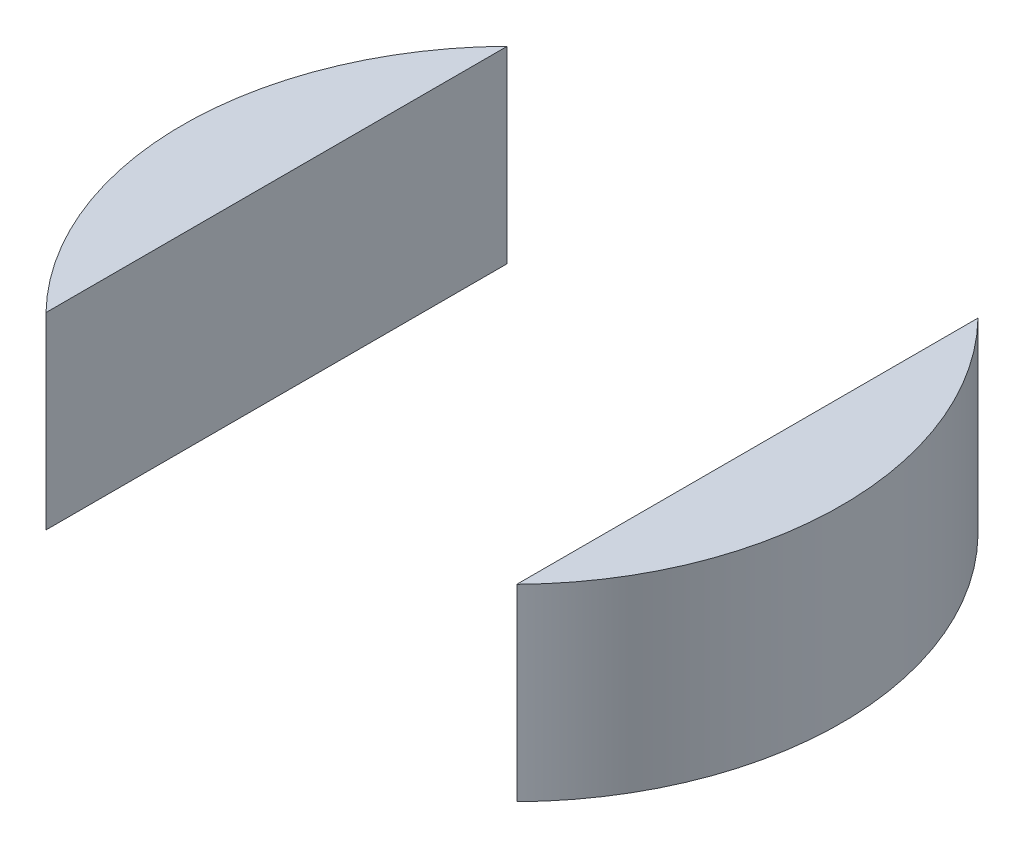
ISO-10303-21;
HEADER;
FILE_DESCRIPTION(('STEP AP214'),'2;1');
FILE_NAME('part.step','',(''),(''),'','','');
FILE_SCHEMA(('AUTOMOTIVE_DESIGN { 1 0 10303 214 1 1 1 1 }'));
ENDSEC;
DATA;
#1=APPLICATION_CONTEXT('core data for automotive mechanical design processes');
#2=APPLICATION_PROTOCOL_DEFINITION('international standard','automotive_design',2000,#1);
#3=PRODUCT_CONTEXT('',#1,'mechanical');
#4=PRODUCT('Part','Part','',(#3));
#5=PRODUCT_RELATED_PRODUCT_CATEGORY('part','',(#4));
#6=PRODUCT_DEFINITION_FORMATION('','',#4);
#7=PRODUCT_DEFINITION_CONTEXT('part definition',#1,'design');
#8=PRODUCT_DEFINITION('design','',#6,#7);
#9=PRODUCT_DEFINITION_SHAPE('','',#8);
#10=(LENGTH_UNIT() NAMED_UNIT(*) SI_UNIT(.MILLI.,.METRE.));
#11=(NAMED_UNIT(*) PLANE_ANGLE_UNIT() SI_UNIT($,.RADIAN.));
#12=(NAMED_UNIT(*) SI_UNIT($,.STERADIAN.) SOLID_ANGLE_UNIT());
#13=UNCERTAINTY_MEASURE_WITH_UNIT(LENGTH_MEASURE(1.E-05),#10,'distance_accuracy_value','');
#14=(GEOMETRIC_REPRESENTATION_CONTEXT(3) GLOBAL_UNCERTAINTY_ASSIGNED_CONTEXT((#13)) GLOBAL_UNIT_ASSIGNED_CONTEXT((#10,
#11,#12)) REPRESENTATION_CONTEXT('',''));
#15=CARTESIAN_POINT('',(0.,0.,0.));
#16=DIRECTION('',(0.,0.,1.));
#17=DIRECTION('',(1.,0.,0.));
#18=AXIS2_PLACEMENT_3D('',#15,#16,#17);
#19=CARTESIAN_POINT('',(0.,10.,0.));
#20=DIRECTION('',(0.,-1.,0.));
#21=DIRECTION('',(0.,0.,-1.));
#22=AXIS2_PLACEMENT_3D('',#19,#20,#21);
#23=CYLINDRICAL_SURFACE('',#22,17.5);
#24=CARTESIAN_POINT('',(0.,0.,0.));
#25=DIRECTION('',(0.,1.,0.));
#26=DIRECTION('',(0.,0.,1.));
#27=AXIS2_PLACEMENT_3D('',#24,#25,#26);
#28=CIRCLE('',#27,17.5);
#29=CARTESIAN_POINT('',(12.5,0.,12.2474487139159));
#30=VERTEX_POINT('',#29);
#31=CARTESIAN_POINT('',(12.5,0.,-12.2474487139159));
#32=VERTEX_POINT('',#31);
#33=EDGE_CURVE('E90',#30,#32,#28,.T.);
#34=ORIENTED_EDGE('',*,*,#33,.T.);
#35=DIRECTION('',(0.,-1.,0.));
#36=VECTOR('',#35,1.);
#37=CARTESIAN_POINT('',(12.5,10.,-12.2474487139159));
#38=LINE('',#37,#36);
#39=CARTESIAN_POINT('',(12.5,10.,-12.2474487139159));
#40=VERTEX_POINT('',#39);
#41=EDGE_CURVE('E12',#40,#32,#38,.T.);
#42=ORIENTED_EDGE('',*,*,#41,.F.);
#43=CARTESIAN_POINT('',(0.,10.,0.));
#44=DIRECTION('',(0.,1.,0.));
#45=DIRECTION('',(0.,0.,1.));
#46=AXIS2_PLACEMENT_3D('',#43,#44,#45);
#47=CIRCLE('',#46,17.5);
#48=CARTESIAN_POINT('',(12.5,10.,12.2474487139159));
#49=VERTEX_POINT('',#48);
#50=EDGE_CURVE('E89',#49,#40,#47,.T.);
#51=ORIENTED_EDGE('',*,*,#50,.F.);
#52=DIRECTION('',(0.,-1.,0.));
#53=VECTOR('',#52,1.);
#54=CARTESIAN_POINT('',(12.5,10.,12.2474487139159));
#55=LINE('',#54,#53);
#56=EDGE_CURVE('E66',#49,#30,#55,.T.);
#57=ORIENTED_EDGE('',*,*,#56,.T.);
#58=EDGE_LOOP('',(#34,#42,#51,#57));
#59=FACE_BOUND('',#58,.T.);
#60=ADVANCED_FACE('F57',(#59),#23,.T.);
#61=CARTESIAN_POINT('',(12.5,10.,0.));
#62=DIRECTION('',(1.,0.,0.));
#63=DIRECTION('',(0.,0.,-1.));
#64=AXIS2_PLACEMENT_3D('',#61,#62,#63);
#65=PLANE('',#64);
#66=DIRECTION('',(0.,0.,1.));
#67=VECTOR('',#66,1.);
#68=CARTESIAN_POINT('',(12.5,0.,0.));
#69=LINE('',#68,#67);
#70=EDGE_CURVE('E81',#32,#30,#69,.T.);
#71=ORIENTED_EDGE('',*,*,#70,.T.);
#72=ORIENTED_EDGE('',*,*,#56,.F.);
#73=DIRECTION('',(0.,0.,1.));
#74=VECTOR('',#73,1.);
#75=CARTESIAN_POINT('',(12.5,10.,0.));
#76=LINE('',#75,#74);
#77=EDGE_CURVE('E73',#40,#49,#76,.T.);
#78=ORIENTED_EDGE('',*,*,#77,.F.);
#79=ORIENTED_EDGE('',*,*,#41,.T.);
#80=EDGE_LOOP('',(#71,#72,#78,#79));
#81=FACE_BOUND('',#80,.T.);
#82=ADVANCED_FACE('F84',(#81),#65,.F.);
#83=CARTESIAN_POINT('',(0.,10.,0.));
#84=DIRECTION('',(0.,1.,0.));
#85=DIRECTION('',(0.,0.,1.));
#86=AXIS2_PLACEMENT_3D('',#83,#84,#85);
#87=PLANE('',#86);
#88=ORIENTED_EDGE('',*,*,#50,.T.);
#89=ORIENTED_EDGE('',*,*,#77,.T.);
#90=EDGE_LOOP('',(#88,#89));
#91=FACE_BOUND('',#90,.T.);
#92=ADVANCED_FACE('F101',(#91),#87,.T.);
#93=CARTESIAN_POINT('',(0.,0.,0.));
#94=DIRECTION('',(0.,1.,0.));
#95=DIRECTION('',(0.,0.,1.));
#96=AXIS2_PLACEMENT_3D('',#93,#94,#95);
#97=PLANE('',#96);
#98=ORIENTED_EDGE('',*,*,#33,.F.);
#99=ORIENTED_EDGE('',*,*,#70,.F.);
#100=EDGE_LOOP('',(#98,#99));
#101=FACE_BOUND('',#100,.T.);
#102=ADVANCED_FACE('F94',(#101),#97,.F.);
#103=CLOSED_SHELL('',(#60,#82,#92,#102));
#104=MANIFOLD_SOLID_BREP('B2',#103);
#105=CARTESIAN_POINT('',(0.,10.,0.));
#106=DIRECTION('',(0.,-1.,0.));
#107=DIRECTION('',(0.,0.,-1.));
#108=AXIS2_PLACEMENT_3D('',#105,#106,#107);
#109=CYLINDRICAL_SURFACE('',#108,17.5);
#110=CARTESIAN_POINT('',(0.,0.,0.));
#111=DIRECTION('',(0.,1.,0.));
#112=DIRECTION('',(0.,0.,1.));
#113=AXIS2_PLACEMENT_3D('',#110,#111,#112);
#114=CIRCLE('',#113,17.5);
#115=CARTESIAN_POINT('',(-12.5,0.,-12.2474487139159));
#116=VERTEX_POINT('',#115);
#117=CARTESIAN_POINT('',(-12.5,0.,12.2474487139159));
#118=VERTEX_POINT('',#117);
#119=EDGE_CURVE('E177',#116,#118,#114,.T.);
#120=ORIENTED_EDGE('',*,*,#119,.T.);
#121=DIRECTION('',(0.,-1.,0.));
#122=VECTOR('',#121,1.);
#123=CARTESIAN_POINT('',(-12.5,10.,12.2474487139159));
#124=LINE('',#123,#122);
#125=CARTESIAN_POINT('',(-12.5,10.,12.2474487139159));
#126=VERTEX_POINT('',#125);
#127=EDGE_CURVE('E55',#126,#118,#124,.T.);
#128=ORIENTED_EDGE('',*,*,#127,.F.);
#129=CARTESIAN_POINT('',(0.,10.,0.));
#130=DIRECTION('',(0.,1.,0.));
#131=DIRECTION('',(0.,0.,1.));
#132=AXIS2_PLACEMENT_3D('',#129,#130,#131);
#133=CIRCLE('',#132,17.5);
#134=CARTESIAN_POINT('',(-12.5,10.,-12.2474487139159));
#135=VERTEX_POINT('',#134);
#136=EDGE_CURVE('E179',#135,#126,#133,.T.);
#137=ORIENTED_EDGE('',*,*,#136,.F.);
#138=DIRECTION('',(0.,-1.,0.));
#139=VECTOR('',#138,1.);
#140=CARTESIAN_POINT('',(-12.5,10.,-12.2474487139159));
#141=LINE('',#140,#139);
#142=EDGE_CURVE('E161',#135,#116,#141,.T.);
#143=ORIENTED_EDGE('',*,*,#142,.T.);
#144=EDGE_LOOP('',(#120,#128,#137,#143));
#145=FACE_BOUND('',#144,.T.);
#146=ADVANCED_FACE('F153',(#145),#109,.T.);
#147=CARTESIAN_POINT('',(-12.5,10.,0.));
#148=DIRECTION('',(1.,0.,0.));
#149=DIRECTION('',(0.,0.,-1.));
#150=AXIS2_PLACEMENT_3D('',#147,#148,#149);
#151=PLANE('',#150);
#152=DIRECTION('',(0.,0.,1.));
#153=VECTOR('',#152,1.);
#154=CARTESIAN_POINT('',(-12.5,0.,0.));
#155=LINE('',#154,#153);
#156=EDGE_CURVE('E184',#116,#118,#155,.T.);
#157=ORIENTED_EDGE('',*,*,#156,.F.);
#158=ORIENTED_EDGE('',*,*,#142,.F.);
#159=DIRECTION('',(0.,0.,1.));
#160=VECTOR('',#159,1.);
#161=CARTESIAN_POINT('',(-12.5,10.,0.));
#162=LINE('',#161,#160);
#163=EDGE_CURVE('E181',#135,#126,#162,.T.);
#164=ORIENTED_EDGE('',*,*,#163,.T.);
#165=ORIENTED_EDGE('',*,*,#127,.T.);
#166=EDGE_LOOP('',(#157,#158,#164,#165));
#167=FACE_BOUND('',#166,.T.);
#168=ADVANCED_FACE('F186',(#167),#151,.T.);
#169=CARTESIAN_POINT('',(0.,10.,0.));
#170=DIRECTION('',(0.,1.,0.));
#171=DIRECTION('',(0.,0.,1.));
#172=AXIS2_PLACEMENT_3D('',#169,#170,#171);
#173=PLANE('',#172);
#174=ORIENTED_EDGE('',*,*,#136,.T.);
#175=ORIENTED_EDGE('',*,*,#163,.F.);
#176=EDGE_LOOP('',(#174,#175));
#177=FACE_BOUND('',#176,.T.);
#178=ADVANCED_FACE('F191',(#177),#173,.T.);
#179=CARTESIAN_POINT('',(0.,0.,0.));
#180=DIRECTION('',(0.,1.,0.));
#181=DIRECTION('',(0.,0.,1.));
#182=AXIS2_PLACEMENT_3D('',#179,#180,#181);
#183=PLANE('',#182);
#184=ORIENTED_EDGE('',*,*,#119,.F.);
#185=ORIENTED_EDGE('',*,*,#156,.T.);
#186=EDGE_LOOP('',(#184,#185));
#187=FACE_BOUND('',#186,.T.);
#188=ADVANCED_FACE('F183',(#187),#183,.F.);
#189=CLOSED_SHELL('',(#146,#168,#178,#188));
#190=MANIFOLD_SOLID_BREP('B6',#189);
#191=ADVANCED_BREP_SHAPE_REPRESENTATION('',(#18,#104,#190),#14);
#192=SHAPE_DEFINITION_REPRESENTATION(#9,#191);
ENDSEC;
END-ISO-10303-21;
